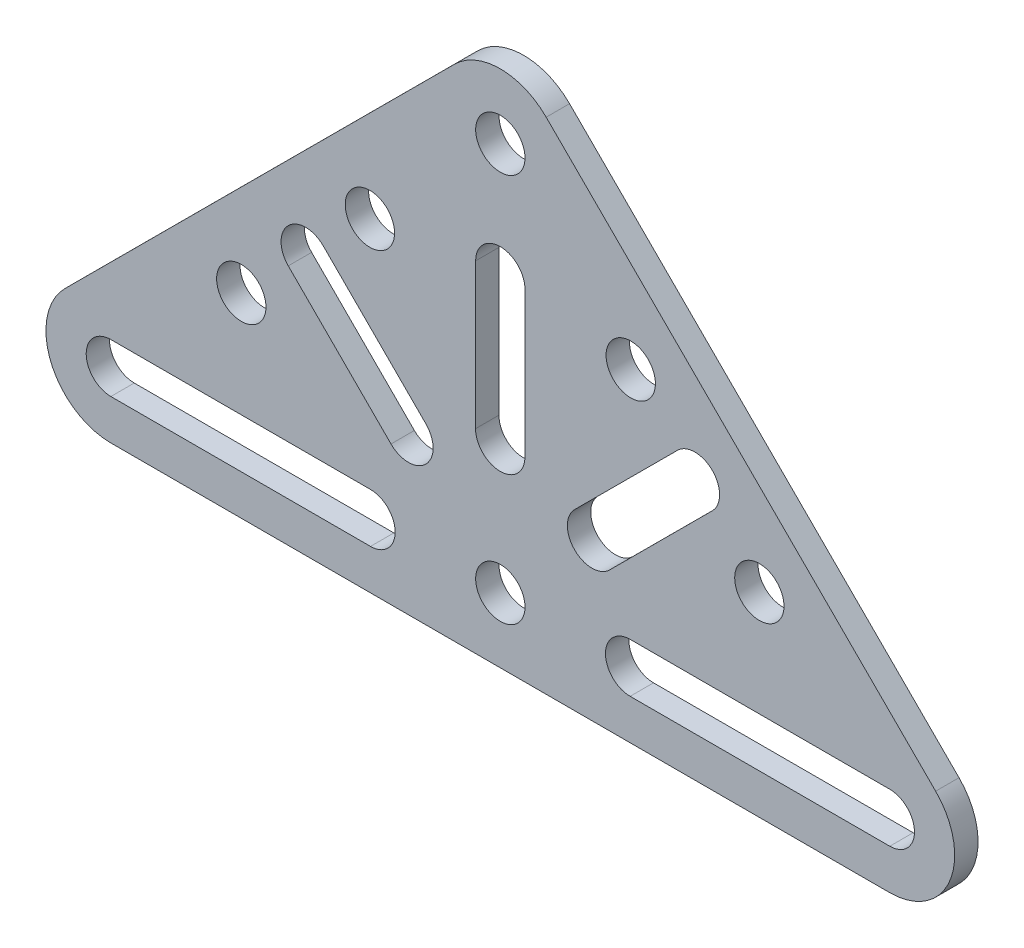
ISO-10303-21;
HEADER;
FILE_DESCRIPTION(('STEP AP214'),'2;1');
FILE_NAME('part.step','',(''),(''),'','','');
FILE_SCHEMA(('AUTOMOTIVE_DESIGN { 1 0 10303 214 1 1 1 1 }'));
ENDSEC;
DATA;
#1=APPLICATION_CONTEXT('core data for automotive mechanical design processes');
#2=APPLICATION_PROTOCOL_DEFINITION('international standard','automotive_design',2000,#1);
#3=PRODUCT_CONTEXT('',#1,'mechanical');
#4=PRODUCT('Part','Part','',(#3));
#5=PRODUCT_RELATED_PRODUCT_CATEGORY('part','',(#4));
#6=PRODUCT_DEFINITION_FORMATION('','',#4);
#7=PRODUCT_DEFINITION_CONTEXT('part definition',#1,'design');
#8=PRODUCT_DEFINITION('design','',#6,#7);
#9=PRODUCT_DEFINITION_SHAPE('','',#8);
#10=(LENGTH_UNIT() NAMED_UNIT(*) SI_UNIT(.MILLI.,.METRE.));
#11=(NAMED_UNIT(*) PLANE_ANGLE_UNIT() SI_UNIT($,.RADIAN.));
#12=(NAMED_UNIT(*) SI_UNIT($,.STERADIAN.) SOLID_ANGLE_UNIT());
#13=UNCERTAINTY_MEASURE_WITH_UNIT(LENGTH_MEASURE(1.E-05),#10,'distance_accuracy_value','');
#14=(GEOMETRIC_REPRESENTATION_CONTEXT(3) GLOBAL_UNCERTAINTY_ASSIGNED_CONTEXT((#13)) GLOBAL_UNIT_ASSIGNED_CONTEXT((#10,
#11,#12)) REPRESENTATION_CONTEXT('',''));
#15=CARTESIAN_POINT('',(0.,0.,0.));
#16=DIRECTION('',(0.,0.,1.));
#17=DIRECTION('',(1.,0.,0.));
#18=AXIS2_PLACEMENT_3D('',#15,#16,#17);
#19=CARTESIAN_POINT('',(-38.1,0.,2.286));
#20=DIRECTION('',(0.,0.,-1.));
#21=DIRECTION('',(-1.,0.,0.));
#22=AXIS2_PLACEMENT_3D('',#19,#20,#21);
#23=CYLINDRICAL_SURFACE('',#22,6.35);
#24=CARTESIAN_POINT('',(-38.1,0.,0.));
#25=DIRECTION('',(0.,0.,1.));
#26=DIRECTION('',(1.,0.,0.));
#27=AXIS2_PLACEMENT_3D('',#24,#25,#26);
#28=CIRCLE('',#27,6.35);
#29=CARTESIAN_POINT('',(-42.5873298500313,4.49292452830198,0.));
#30=VERTEX_POINT('',#29);
#31=CARTESIAN_POINT('',(-38.0999999999998,-6.35000000000001,0.));
#32=VERTEX_POINT('',#31);
#33=EDGE_CURVE('E401',#30,#32,#28,.T.);
#34=ORIENTED_EDGE('',*,*,#33,.T.);
#35=DIRECTION('',(0.,0.,-1.));
#36=VECTOR('',#35,1.);
#37=CARTESIAN_POINT('',(-38.0999999999998,-6.35000000000001,2.286));
#38=LINE('',#37,#36);
#39=CARTESIAN_POINT('',(-38.0999999999998,-6.35000000000001,2.286));
#40=VERTEX_POINT('',#39);
#41=EDGE_CURVE('E11',#40,#32,#38,.T.);
#42=ORIENTED_EDGE('',*,*,#41,.F.);
#43=CARTESIAN_POINT('',(-38.1,0.,2.286));
#44=DIRECTION('',(0.,0.,1.));
#45=DIRECTION('',(1.,0.,0.));
#46=AXIS2_PLACEMENT_3D('',#43,#44,#45);
#47=CIRCLE('',#46,6.35);
#48=CARTESIAN_POINT('',(-42.5873298500313,4.49292452830198,2.286));
#49=VERTEX_POINT('',#48);
#50=EDGE_CURVE('E404',#49,#40,#47,.T.);
#51=ORIENTED_EDGE('',*,*,#50,.F.);
#52=DIRECTION('',(0.,0.,-1.));
#53=VECTOR('',#52,1.);
#54=CARTESIAN_POINT('',(-42.5873298500313,4.49292452830198,2.286));
#55=LINE('',#54,#53);
#56=EDGE_CURVE('E418',#49,#30,#55,.T.);
#57=ORIENTED_EDGE('',*,*,#56,.T.);
#58=EDGE_LOOP('',(#34,#42,#51,#57));
#59=FACE_BOUND('',#58,.T.);
#60=ADVANCED_FACE('F32',(#59),#23,.T.);
#61=CARTESIAN_POINT('',(38.0999999999998,-6.35000000000001,2.286));
#62=DIRECTION('',(0.,1.,0.));
#63=DIRECTION('',(0.,0.,1.));
#64=AXIS2_PLACEMENT_3D('',#61,#62,#63);
#65=PLANE('',#64);
#66=DIRECTION('',(1.,0.,0.));
#67=VECTOR('',#66,1.);
#68=CARTESIAN_POINT('',(38.0999999999998,-6.35000000000001,0.));
#69=LINE('',#68,#67);
#70=CARTESIAN_POINT('',(38.0999999999998,-6.35000000000001,0.));
#71=VERTEX_POINT('',#70);
#72=EDGE_CURVE('E421',#32,#71,#69,.T.);
#73=ORIENTED_EDGE('',*,*,#72,.T.);
#74=DIRECTION('',(0.,0.,-1.));
#75=VECTOR('',#74,1.);
#76=CARTESIAN_POINT('',(38.0999999999998,-6.35000000000001,2.286));
#77=LINE('',#76,#75);
#78=CARTESIAN_POINT('',(38.0999999999998,-6.35000000000001,2.286));
#79=VERTEX_POINT('',#78);
#80=EDGE_CURVE('E39',#79,#71,#77,.T.);
#81=ORIENTED_EDGE('',*,*,#80,.F.);
#82=DIRECTION('',(1.,0.,0.));
#83=VECTOR('',#82,1.);
#84=CARTESIAN_POINT('',(38.0999999999998,-6.35000000000001,2.286));
#85=LINE('',#84,#83);
#86=EDGE_CURVE('E407',#40,#79,#85,.T.);
#87=ORIENTED_EDGE('',*,*,#86,.F.);
#88=ORIENTED_EDGE('',*,*,#41,.T.);
#89=EDGE_LOOP('',(#73,#81,#87,#88));
#90=FACE_BOUND('',#89,.T.);
#91=ADVANCED_FACE('F467',(#90),#65,.F.);
#92=CARTESIAN_POINT('',(38.1,0.,2.286));
#93=DIRECTION('',(0.,0.,-1.));
#94=DIRECTION('',(-1.,0.,0.));
#95=AXIS2_PLACEMENT_3D('',#92,#93,#94);
#96=CYLINDRICAL_SURFACE('',#95,6.35);
#97=CARTESIAN_POINT('',(38.1,0.,0.));
#98=DIRECTION('',(0.,0.,1.));
#99=DIRECTION('',(-1.,0.,0.));
#100=AXIS2_PLACEMENT_3D('',#97,#98,#99);
#101=CIRCLE('',#100,6.35);
#102=CARTESIAN_POINT('',(42.5873298500313,4.49292452830198,0.));
#103=VERTEX_POINT('',#102);
#104=EDGE_CURVE('E423',#71,#103,#101,.T.);
#105=ORIENTED_EDGE('',*,*,#104,.T.);
#106=DIRECTION('',(0.,0.,-1.));
#107=VECTOR('',#106,1.);
#108=CARTESIAN_POINT('',(42.5873298500313,4.49292452830198,2.286));
#109=LINE('',#108,#107);
#110=CARTESIAN_POINT('',(42.5873298500313,4.49292452830198,2.286));
#111=VERTEX_POINT('',#110);
#112=EDGE_CURVE('E438',#111,#103,#109,.T.);
#113=ORIENTED_EDGE('',*,*,#112,.F.);
#114=CARTESIAN_POINT('',(38.1,0.,2.286));
#115=DIRECTION('',(0.,0.,1.));
#116=DIRECTION('',(-1.,0.,0.));
#117=AXIS2_PLACEMENT_3D('',#114,#115,#116);
#118=CIRCLE('',#117,6.35);
#119=EDGE_CURVE('E410',#79,#111,#118,.T.);
#120=ORIENTED_EDGE('',*,*,#119,.F.);
#121=ORIENTED_EDGE('',*,*,#80,.T.);
#122=EDGE_LOOP('',(#105,#113,#120,#121));
#123=FACE_BOUND('',#122,.T.);
#124=ADVANCED_FACE('F445',(#123),#96,.T.);
#125=CARTESIAN_POINT('',(42.5873298500313,4.49292452830198,2.286));
#126=DIRECTION('',(-0.706666118115189,-0.707547169811321,0.));
#127=DIRECTION('',(0.707547169811321,-0.706666118115189,0.));
#128=AXIS2_PLACEMENT_3D('',#125,#126,#127);
#129=PLANE('',#128);
#130=DIRECTION('',(-0.707547169811321,0.706666118115189,0.));
#131=VECTOR('',#130,1.);
#132=CARTESIAN_POINT('',(42.5873298500313,4.49292452830198,0.));
#133=LINE('',#132,#131);
#134=CARTESIAN_POINT('',(4.48732985003148,42.5454816565685,0.));
#135=VERTEX_POINT('',#134);
#136=EDGE_CURVE('E425',#103,#135,#133,.T.);
#137=ORIENTED_EDGE('',*,*,#136,.T.);
#138=DIRECTION('',(0.,0.,-1.));
#139=VECTOR('',#138,1.);
#140=CARTESIAN_POINT('',(4.48732985003148,42.5454816565685,2.286));
#141=LINE('',#140,#139);
#142=CARTESIAN_POINT('',(4.48732985003148,42.5454816565685,2.286));
#143=VERTEX_POINT('',#142);
#144=EDGE_CURVE('E435',#143,#135,#141,.T.);
#145=ORIENTED_EDGE('',*,*,#144,.F.);
#146=DIRECTION('',(-0.707547169811321,0.706666118115189,0.));
#147=VECTOR('',#146,1.);
#148=CARTESIAN_POINT('',(42.5873298500313,4.49292452830198,2.286));
#149=LINE('',#148,#147);
#150=EDGE_CURVE('E412',#111,#143,#149,.T.);
#151=ORIENTED_EDGE('',*,*,#150,.F.);
#152=ORIENTED_EDGE('',*,*,#112,.T.);
#153=EDGE_LOOP('',(#137,#145,#151,#152));
#154=FACE_BOUND('',#153,.T.);
#155=ADVANCED_FACE('F456',(#154),#129,.F.);
#156=CARTESIAN_POINT('',(0.,38.0525571282667,2.286));
#157=DIRECTION('',(0.,0.,-1.));
#158=DIRECTION('',(-1.,0.,0.));
#159=AXIS2_PLACEMENT_3D('',#156,#157,#158);
#160=CYLINDRICAL_SURFACE('',#159,6.35);
#161=CARTESIAN_POINT('',(0.,38.0525571282667,0.));
#162=DIRECTION('',(0.,0.,1.));
#163=DIRECTION('',(-1.,0.,0.));
#164=AXIS2_PLACEMENT_3D('',#161,#162,#163);
#165=CIRCLE('',#164,6.35);
#166=CARTESIAN_POINT('',(-4.48732985003148,42.5454816565685,0.));
#167=VERTEX_POINT('',#166);
#168=EDGE_CURVE('E427',#135,#167,#165,.T.);
#169=ORIENTED_EDGE('',*,*,#168,.T.);
#170=DIRECTION('',(0.,0.,-1.));
#171=VECTOR('',#170,1.);
#172=CARTESIAN_POINT('',(-4.48732985003148,42.5454816565685,2.286));
#173=LINE('',#172,#171);
#174=CARTESIAN_POINT('',(-4.48732985003148,42.5454816565685,2.286));
#175=VERTEX_POINT('',#174);
#176=EDGE_CURVE('E432',#175,#167,#173,.T.);
#177=ORIENTED_EDGE('',*,*,#176,.F.);
#178=CARTESIAN_POINT('',(0.,38.0525571282667,2.286));
#179=DIRECTION('',(0.,0.,1.));
#180=DIRECTION('',(-1.,0.,0.));
#181=AXIS2_PLACEMENT_3D('',#178,#179,#180);
#182=CIRCLE('',#181,6.35);
#183=EDGE_CURVE('E414',#143,#175,#182,.T.);
#184=ORIENTED_EDGE('',*,*,#183,.F.);
#185=ORIENTED_EDGE('',*,*,#144,.T.);
#186=EDGE_LOOP('',(#169,#177,#184,#185));
#187=FACE_BOUND('',#186,.T.);
#188=ADVANCED_FACE('F460',(#187),#160,.T.);
#189=CARTESIAN_POINT('',(-42.5873298500313,4.49292452830198,2.286));
#190=DIRECTION('',(0.706666118115189,-0.707547169811321,0.));
#191=DIRECTION('',(0.707547169811321,0.706666118115189,0.));
#192=AXIS2_PLACEMENT_3D('',#189,#190,#191);
#193=PLANE('',#192);
#194=DIRECTION('',(-0.707547169811321,-0.706666118115189,0.));
#195=VECTOR('',#194,1.);
#196=CARTESIAN_POINT('',(-42.5873298500313,4.49292452830198,0.));
#197=LINE('',#196,#195);
#198=EDGE_CURVE('E408',#167,#30,#197,.T.);
#199=ORIENTED_EDGE('',*,*,#198,.T.);
#200=ORIENTED_EDGE('',*,*,#56,.F.);
#201=DIRECTION('',(-0.707547169811321,-0.706666118115189,0.));
#202=VECTOR('',#201,1.);
#203=CARTESIAN_POINT('',(-42.5873298500313,4.49292452830198,2.286));
#204=LINE('',#203,#202);
#205=EDGE_CURVE('E416',#175,#49,#204,.T.);
#206=ORIENTED_EDGE('',*,*,#205,.F.);
#207=ORIENTED_EDGE('',*,*,#176,.T.);
#208=EDGE_LOOP('',(#199,#200,#206,#207));
#209=FACE_BOUND('',#208,.T.);
#210=ADVANCED_FACE('F470',(#209),#193,.F.);
#211=CARTESIAN_POINT('',(-38.1,0.,2.286));
#212=DIRECTION('',(0.,0.,1.));
#213=DIRECTION('',(1.,0.,0.));
#214=AXIS2_PLACEMENT_3D('',#211,#212,#213);
#215=PLANE('',#214);
#216=CARTESIAN_POINT('',(19.0381318928662,19.038131892866,2.286));
#217=DIRECTION('',(0.,0.,1.));
#218=DIRECTION('',(0.,-1.,0.));
#219=AXIS2_PLACEMENT_3D('',#216,#217,#218);
#220=CIRCLE('',#219,2.413);
#221=CARTESIAN_POINT('',(20.7433172358781,17.3308205721113,2.286));
#222=VERTEX_POINT('',#221);
#223=CARTESIAN_POINT('',(17.3329465498542,20.7454432136207,2.286));
#224=VERTEX_POINT('',#223);
#225=EDGE_CURVE('E46',#222,#224,#220,.T.);
#226=ORIENTED_EDGE('',*,*,#225,.F.);
#227=DIRECTION('',(0.707547169811323,0.706666118115187,0.));
#228=VECTOR('',#227,1.);
#229=CARTESIAN_POINT('',(20.7433172358781,17.3308205721113,2.286));
#230=LINE('',#229,#228);
#231=CARTESIAN_POINT('',(10.6791662924818,7.27920170804089,2.286));
#232=VERTEX_POINT('',#231);
#233=EDGE_CURVE('E222',#232,#222,#230,.T.);
#234=ORIENTED_EDGE('',*,*,#233,.F.);
#235=CARTESIAN_POINT('',(8.97398094946989,8.98651302879561,2.286));
#236=DIRECTION('',(0.,0.,1.));
#237=DIRECTION('',(0.,1.,0.));
#238=AXIS2_PLACEMENT_3D('',#235,#236,#237);
#239=CIRCLE('',#238,2.413);
#240=CARTESIAN_POINT('',(7.26879560645795,10.6938243495503,2.286));
#241=VERTEX_POINT('',#240);
#242=EDGE_CURVE('E216',#241,#232,#239,.T.);
#243=ORIENTED_EDGE('',*,*,#242,.F.);
#244=DIRECTION('',(-0.707547169811323,-0.706666118115186,0.));
#245=VECTOR('',#244,1.);
#246=CARTESIAN_POINT('',(17.3329465498542,20.7454432136207,2.286));
#247=LINE('',#246,#245);
#248=EDGE_CURVE('E206',#224,#241,#247,.T.);
#249=ORIENTED_EDGE('',*,*,#248,.F.);
#250=EDGE_LOOP('',(#226,#234,#243,#249));
#251=FACE_BOUND('',#250,.T.);
#252=CARTESIAN_POINT('',(0.,26.923984325139,2.286));
#253=DIRECTION('',(0.,0.,1.));
#254=DIRECTION('',(0.707106781186546,-0.707106781186549,0.));
#255=AXIS2_PLACEMENT_3D('',#252,#253,#254);
#256=CIRCLE('',#255,2.413);
#257=CARTESIAN_POINT('',(2.41299953172593,26.9224810318604,2.286));
#258=VERTEX_POINT('',#257);
#259=CARTESIAN_POINT('',(-2.41299953172583,26.9254876184176,2.286));
#260=VERTEX_POINT('',#259);
#261=EDGE_CURVE('E266',#258,#260,#256,.T.);
#262=ORIENTED_EDGE('',*,*,#261,.F.);
#263=DIRECTION('',(0.000622997628912436,0.999999805936958,0.));
#264=VECTOR('',#263,1.);
#265=CARTESIAN_POINT('',(2.41299953172593,26.9224810318604,2.286));
#266=LINE('',#265,#264);
#267=CARTESIAN_POINT('',(2.40413801345228,12.6984837922131,2.286));
#268=VERTEX_POINT('',#267);
#269=EDGE_CURVE('E258',#268,#258,#266,.T.);
#270=ORIENTED_EDGE('',*,*,#269,.F.);
#271=CARTESIAN_POINT('',(-0.00886151827360088,12.6999870854917,2.286));
#272=DIRECTION('',(0.,0.,1.));
#273=DIRECTION('',(-0.707106781186546,0.707106781186549,0.));
#274=AXIS2_PLACEMENT_3D('',#271,#272,#273);
#275=CIRCLE('',#274,2.413);
#276=CARTESIAN_POINT('',(-2.42186104999948,12.7014903787703,2.286));
#277=VERTEX_POINT('',#276);
#278=EDGE_CURVE('E250',#277,#268,#275,.T.);
#279=ORIENTED_EDGE('',*,*,#278,.F.);
#280=DIRECTION('',(-0.000622997628912603,-0.999999805936958,0.));
#281=VECTOR('',#280,1.);
#282=CARTESIAN_POINT('',(-2.41299953172583,26.9254876184175,2.286));
#283=LINE('',#282,#281);
#284=EDGE_CURVE('E239',#260,#277,#283,.T.);
#285=ORIENTED_EDGE('',*,*,#284,.F.);
#286=EDGE_LOOP('',(#262,#270,#279,#285));
#287=FACE_BOUND('',#286,.T.);
#288=CARTESIAN_POINT('',(-19.0381318928661,19.0381318928661,2.286));
#289=DIRECTION('',(0.,0.,1.));
#290=DIRECTION('',(1.,0.,0.));
#291=AXIS2_PLACEMENT_3D('',#288,#289,#290);
#292=CIRCLE('',#291,2.413);
#293=CARTESIAN_POINT('',(-17.3308205721114,20.743317235878,2.286));
#294=VERTEX_POINT('',#293);
#295=CARTESIAN_POINT('',(-20.7454432136208,17.3329465498541,2.286));
#296=VERTEX_POINT('',#295);
#297=EDGE_CURVE('E271',#294,#296,#292,.T.);
#298=ORIENTED_EDGE('',*,*,#297,.F.);
#299=DIRECTION('',(-0.706666118115189,0.707547169811321,0.));
#300=VECTOR('',#299,1.);
#301=CARTESIAN_POINT('',(-17.3308205721114,20.743317235878,2.286));
#302=LINE('',#301,#300);
#303=CARTESIAN_POINT('',(-7.27920170804092,10.6791662924818,2.286));
#304=VERTEX_POINT('',#303);
#305=EDGE_CURVE('E276',#304,#294,#302,.T.);
#306=ORIENTED_EDGE('',*,*,#305,.F.);
#307=CARTESIAN_POINT('',(-8.98651302879564,8.97398094946986,2.286));
#308=DIRECTION('',(0.,0.,1.));
#309=DIRECTION('',(-1.,0.,0.));
#310=AXIS2_PLACEMENT_3D('',#307,#308,#309);
#311=CIRCLE('',#310,2.413);
#312=CARTESIAN_POINT('',(-10.6938243495504,7.26879560645791,2.286));
#313=VERTEX_POINT('',#312);
#314=EDGE_CURVE('E290',#313,#304,#311,.T.);
#315=ORIENTED_EDGE('',*,*,#314,.F.);
#316=DIRECTION('',(0.706666118115189,-0.707547169811321,0.));
#317=VECTOR('',#316,1.);
#318=CARTESIAN_POINT('',(-20.7454432136208,17.3329465498541,2.286));
#319=LINE('',#318,#317);
#320=EDGE_CURVE('E287',#296,#313,#319,.T.);
#321=ORIENTED_EDGE('',*,*,#320,.F.);
#322=EDGE_LOOP('',(#298,#306,#315,#321));
#323=FACE_BOUND('',#322,.T.);
#324=CARTESIAN_POINT('',(38.1,0.,2.286));
#325=DIRECTION('',(0.,0.,-1.));
#326=DIRECTION('',(-1.,0.,0.));
#327=AXIS2_PLACEMENT_3D('',#324,#325,#326);
#328=CIRCLE('',#327,2.41299999999999);
#329=CARTESIAN_POINT('',(38.1,2.41299999999998,2.286));
#330=VERTEX_POINT('',#329);
#331=CARTESIAN_POINT('',(38.1,-2.413,2.286));
#332=VERTEX_POINT('',#331);
#333=EDGE_CURVE('E330',#330,#332,#328,.T.);
#334=ORIENTED_EDGE('',*,*,#333,.T.);
#335=DIRECTION('',(-1.,0.,0.));
#336=VECTOR('',#335,1.);
#337=CARTESIAN_POINT('',(38.1,-2.413,2.286));
#338=LINE('',#337,#336);
#339=CARTESIAN_POINT('',(12.7,-2.413,2.286));
#340=VERTEX_POINT('',#339);
#341=EDGE_CURVE('E297',#332,#340,#338,.T.);
#342=ORIENTED_EDGE('',*,*,#341,.T.);
#343=CARTESIAN_POINT('',(12.7,0.,2.286));
#344=DIRECTION('',(0.,0.,-1.));
#345=DIRECTION('',(1.,0.,0.));
#346=AXIS2_PLACEMENT_3D('',#343,#344,#345);
#347=CIRCLE('',#346,2.41299999999999);
#348=CARTESIAN_POINT('',(12.7,2.41299999999998,2.286));
#349=VERTEX_POINT('',#348);
#350=EDGE_CURVE('E314',#340,#349,#347,.T.);
#351=ORIENTED_EDGE('',*,*,#350,.T.);
#352=DIRECTION('',(1.,0.,0.));
#353=VECTOR('',#352,1.);
#354=CARTESIAN_POINT('',(38.1,2.41299999999998,2.286));
#355=LINE('',#354,#353);
#356=EDGE_CURVE('E322',#349,#330,#355,.T.);
#357=ORIENTED_EDGE('',*,*,#356,.T.);
#358=EDGE_LOOP('',(#334,#342,#351,#357));
#359=FACE_BOUND('',#358,.T.);
#360=CARTESIAN_POINT('',(-38.1,0.,2.286));
#361=DIRECTION('',(0.,0.,1.));
#362=DIRECTION('',(1.,0.,0.));
#363=AXIS2_PLACEMENT_3D('',#360,#361,#362);
#364=CIRCLE('',#363,2.41299999999999);
#365=CARTESIAN_POINT('',(-38.1,2.41299999999998,2.286));
#366=VERTEX_POINT('',#365);
#367=CARTESIAN_POINT('',(-38.1,-2.413,2.286));
#368=VERTEX_POINT('',#367);
#369=EDGE_CURVE('E335',#366,#368,#364,.T.);
#370=ORIENTED_EDGE('',*,*,#369,.F.);
#371=DIRECTION('',(-1.,0.,0.));
#372=VECTOR('',#371,1.);
#373=CARTESIAN_POINT('',(-38.1,2.41299999999998,2.286));
#374=LINE('',#373,#372);
#375=CARTESIAN_POINT('',(-12.7,2.41299999999998,2.286));
#376=VERTEX_POINT('',#375);
#377=EDGE_CURVE('E340',#376,#366,#374,.T.);
#378=ORIENTED_EDGE('',*,*,#377,.F.);
#379=CARTESIAN_POINT('',(-12.7,0.,2.286));
#380=DIRECTION('',(0.,0.,1.));
#381=DIRECTION('',(-1.,0.,0.));
#382=AXIS2_PLACEMENT_3D('',#379,#380,#381);
#383=CIRCLE('',#382,2.41299999999999);
#384=CARTESIAN_POINT('',(-12.7,-2.41299999999999,2.286));
#385=VERTEX_POINT('',#384);
#386=EDGE_CURVE('E354',#385,#376,#383,.T.);
#387=ORIENTED_EDGE('',*,*,#386,.F.);
#388=DIRECTION('',(1.,0.,0.));
#389=VECTOR('',#388,1.);
#390=CARTESIAN_POINT('',(-38.1,-2.413,2.286));
#391=LINE('',#390,#389);
#392=EDGE_CURVE('E351',#368,#385,#391,.T.);
#393=ORIENTED_EDGE('',*,*,#392,.F.);
#394=EDGE_LOOP('',(#370,#378,#387,#393));
#395=FACE_BOUND('',#394,.T.);
#396=CARTESIAN_POINT('',(12.7599056603774,25.3085403541774,2.286));
#397=DIRECTION('',(0.,0.,1.));
#398=DIRECTION('',(-1.,0.,0.));
#399=AXIS2_PLACEMENT_3D('',#396,#397,#398);
#400=CIRCLE('',#399,2.413);
#401=CARTESIAN_POINT('',(10.3469056603774,25.3085403541774,2.286));
#402=VERTEX_POINT('',#401);
#403=EDGE_CURVE('E361',#402,#402,#400,.T.);
#404=ORIENTED_EDGE('',*,*,#403,.F.);
#405=EDGE_LOOP('',(#404));
#406=FACE_BOUND('',#405,.T.);
#407=CARTESIAN_POINT('',(-12.7599056603774,25.3085403541774,2.286));
#408=DIRECTION('',(0.,0.,1.));
#409=DIRECTION('',(1.,0.,0.));
#410=AXIS2_PLACEMENT_3D('',#407,#408,#409);
#411=CIRCLE('',#410,2.413);
#412=CARTESIAN_POINT('',(-10.3469056603774,25.3085403541774,2.286));
#413=VERTEX_POINT('',#412);
#414=EDGE_CURVE('E371',#413,#413,#411,.T.);
#415=ORIENTED_EDGE('',*,*,#414,.F.);
#416=EDGE_LOOP('',(#415));
#417=FACE_BOUND('',#416,.T.);
#418=CARTESIAN_POINT('',(25.3400943396226,12.7440167740893,2.286));
#419=DIRECTION('',(0.,0.,1.));
#420=DIRECTION('',(-1.,0.,0.));
#421=AXIS2_PLACEMENT_3D('',#418,#419,#420);
#422=CIRCLE('',#421,2.41299999999999);
#423=CARTESIAN_POINT('',(22.9270943396226,12.7440167740893,2.286));
#424=VERTEX_POINT('',#423);
#425=EDGE_CURVE('E377',#424,#424,#422,.T.);
#426=ORIENTED_EDGE('',*,*,#425,.F.);
#427=EDGE_LOOP('',(#426));
#428=FACE_BOUND('',#427,.T.);
#429=CARTESIAN_POINT('',(-25.3400943396226,12.7440167740893,2.286));
#430=DIRECTION('',(0.,0.,1.));
#431=DIRECTION('',(1.,0.,0.));
#432=AXIS2_PLACEMENT_3D('',#429,#430,#431);
#433=CIRCLE('',#432,2.413);
#434=CARTESIAN_POINT('',(-22.9270943396226,12.7440167740893,2.286));
#435=VERTEX_POINT('',#434);
#436=EDGE_CURVE('E383',#435,#435,#433,.T.);
#437=ORIENTED_EDGE('',*,*,#436,.F.);
#438=EDGE_LOOP('',(#437));
#439=FACE_BOUND('',#438,.T.);
#440=CARTESIAN_POINT('',(0.,38.0525571282667,2.286));
#441=DIRECTION('',(0.,0.,1.));
#442=DIRECTION('',(1.,0.,0.));
#443=AXIS2_PLACEMENT_3D('',#440,#441,#442);
#444=CIRCLE('',#443,2.413);
#445=CARTESIAN_POINT('',(2.413,38.0525571282667,2.286));
#446=VERTEX_POINT('',#445);
#447=EDGE_CURVE('E389',#446,#446,#444,.T.);
#448=ORIENTED_EDGE('',*,*,#447,.F.);
#449=EDGE_LOOP('',(#448));
#450=FACE_BOUND('',#449,.T.);
#451=CARTESIAN_POINT('',(0.,0.,2.286));
#452=DIRECTION('',(0.,0.,1.));
#453=DIRECTION('',(1.,0.,0.));
#454=AXIS2_PLACEMENT_3D('',#451,#452,#453);
#455=CIRCLE('',#454,2.413);
#456=CARTESIAN_POINT('',(2.413,0.,2.286));
#457=VERTEX_POINT('',#456);
#458=EDGE_CURVE('E395',#457,#457,#455,.T.);
#459=ORIENTED_EDGE('',*,*,#458,.F.);
#460=EDGE_LOOP('',(#459));
#461=FACE_BOUND('',#460,.T.);
#462=ORIENTED_EDGE('',*,*,#50,.T.);
#463=ORIENTED_EDGE('',*,*,#86,.T.);
#464=ORIENTED_EDGE('',*,*,#119,.T.);
#465=ORIENTED_EDGE('',*,*,#150,.T.);
#466=ORIENTED_EDGE('',*,*,#183,.T.);
#467=ORIENTED_EDGE('',*,*,#205,.T.);
#468=EDGE_LOOP('',(#462,#463,#464,#465,#466,#467));
#469=FACE_BOUND('',#468,.T.);
#470=ADVANCED_FACE('F220',(#251,#287,#323,#359,#395,#406,#417,#428,#439,#450,#461,#469),#215,.T.);
#471=CARTESIAN_POINT('',(-38.1,0.,0.));
#472=DIRECTION('',(0.,0.,1.));
#473=DIRECTION('',(1.,0.,0.));
#474=AXIS2_PLACEMENT_3D('',#471,#472,#473);
#475=PLANE('',#474);
#476=DIRECTION('',(0.707547169811323,0.706666118115187,0.));
#477=VECTOR('',#476,1.);
#478=CARTESIAN_POINT('',(20.7433172358781,17.3308205721113,0.));
#479=LINE('',#478,#477);
#480=CARTESIAN_POINT('',(10.6791662924818,7.27920170804089,0.));
#481=VERTEX_POINT('',#480);
#482=CARTESIAN_POINT('',(20.7433172358781,17.3308205721113,0.));
#483=VERTEX_POINT('',#482);
#484=EDGE_CURVE('E232',#481,#483,#479,.T.);
#485=ORIENTED_EDGE('',*,*,#484,.T.);
#486=CARTESIAN_POINT('',(19.0381318928662,19.038131892866,0.));
#487=DIRECTION('',(0.,0.,1.));
#488=DIRECTION('',(0.,-1.,0.));
#489=AXIS2_PLACEMENT_3D('',#486,#487,#488);
#490=CIRCLE('',#489,2.413);
#491=CARTESIAN_POINT('',(17.3329465498542,20.7454432136207,0.));
#492=VERTEX_POINT('',#491);
#493=EDGE_CURVE('E236',#483,#492,#490,.T.);
#494=ORIENTED_EDGE('',*,*,#493,.T.);
#495=DIRECTION('',(-0.707547169811323,-0.706666118115186,0.));
#496=VECTOR('',#495,1.);
#497=CARTESIAN_POINT('',(17.3329465498542,20.7454432136207,0.));
#498=LINE('',#497,#496);
#499=CARTESIAN_POINT('',(7.26879560645795,10.6938243495503,0.));
#500=VERTEX_POINT('',#499);
#501=EDGE_CURVE('E213',#492,#500,#498,.T.);
#502=ORIENTED_EDGE('',*,*,#501,.T.);
#503=CARTESIAN_POINT('',(8.97398094946989,8.98651302879561,0.));
#504=DIRECTION('',(0.,0.,1.));
#505=DIRECTION('',(0.,1.,0.));
#506=AXIS2_PLACEMENT_3D('',#503,#504,#505);
#507=CIRCLE('',#506,2.413);
#508=EDGE_CURVE('E54',#500,#481,#507,.T.);
#509=ORIENTED_EDGE('',*,*,#508,.T.);
#510=EDGE_LOOP('',(#485,#494,#502,#509));
#511=FACE_BOUND('',#510,.T.);
#512=DIRECTION('',(0.000622997628912436,0.999999805936958,0.));
#513=VECTOR('',#512,1.);
#514=CARTESIAN_POINT('',(2.41299953172593,26.9224810318604,0.));
#515=LINE('',#514,#513);
#516=CARTESIAN_POINT('',(2.40413801345228,12.6984837922131,0.));
#517=VERTEX_POINT('',#516);
#518=CARTESIAN_POINT('',(2.41299953172593,26.9224810318604,0.));
#519=VERTEX_POINT('',#518);
#520=EDGE_CURVE('E263',#517,#519,#515,.T.);
#521=ORIENTED_EDGE('',*,*,#520,.T.);
#522=CARTESIAN_POINT('',(0.,26.923984325139,0.));
#523=DIRECTION('',(0.,0.,1.));
#524=DIRECTION('',(0.707106781186546,-0.707106781186549,0.));
#525=AXIS2_PLACEMENT_3D('',#522,#523,#524);
#526=CIRCLE('',#525,2.413);
#527=CARTESIAN_POINT('',(-2.41299953172583,26.9254876184175,0.));
#528=VERTEX_POINT('',#527);
#529=EDGE_CURVE('E268',#519,#528,#526,.T.);
#530=ORIENTED_EDGE('',*,*,#529,.T.);
#531=DIRECTION('',(-0.000622997628912603,-0.999999805936958,0.));
#532=VECTOR('',#531,1.);
#533=CARTESIAN_POINT('',(-2.41299953172583,26.9254876184175,0.));
#534=LINE('',#533,#532);
#535=CARTESIAN_POINT('',(-2.42186104999948,12.7014903787703,0.));
#536=VERTEX_POINT('',#535);
#537=EDGE_CURVE('E241',#528,#536,#534,.T.);
#538=ORIENTED_EDGE('',*,*,#537,.T.);
#539=CARTESIAN_POINT('',(-0.00886151827360088,12.6999870854917,0.));
#540=DIRECTION('',(0.,0.,1.));
#541=DIRECTION('',(-0.707106781186546,0.707106781186549,0.));
#542=AXIS2_PLACEMENT_3D('',#539,#540,#541);
#543=CIRCLE('',#542,2.413);
#544=EDGE_CURVE('E255',#536,#517,#543,.T.);
#545=ORIENTED_EDGE('',*,*,#544,.T.);
#546=EDGE_LOOP('',(#521,#530,#538,#545));
#547=FACE_BOUND('',#546,.T.);
#548=DIRECTION('',(-0.706666118115189,0.707547169811321,0.));
#549=VECTOR('',#548,1.);
#550=CARTESIAN_POINT('',(-17.3308205721114,20.743317235878,0.));
#551=LINE('',#550,#549);
#552=CARTESIAN_POINT('',(-7.27920170804092,10.6791662924818,0.));
#553=VERTEX_POINT('',#552);
#554=CARTESIAN_POINT('',(-17.3308205721114,20.743317235878,0.));
#555=VERTEX_POINT('',#554);
#556=EDGE_CURVE('E282',#553,#555,#551,.T.);
#557=ORIENTED_EDGE('',*,*,#556,.T.);
#558=CARTESIAN_POINT('',(-19.0381318928661,19.0381318928661,0.));
#559=DIRECTION('',(0.,0.,1.));
#560=DIRECTION('',(1.,0.,0.));
#561=AXIS2_PLACEMENT_3D('',#558,#559,#560);
#562=CIRCLE('',#561,2.413);
#563=CARTESIAN_POINT('',(-20.7454432136208,17.3329465498541,0.));
#564=VERTEX_POINT('',#563);
#565=EDGE_CURVE('E272',#555,#564,#562,.T.);
#566=ORIENTED_EDGE('',*,*,#565,.T.);
#567=DIRECTION('',(0.706666118115189,-0.707547169811321,0.));
#568=VECTOR('',#567,1.);
#569=CARTESIAN_POINT('',(-20.7454432136208,17.3329465498541,0.));
#570=LINE('',#569,#568);
#571=CARTESIAN_POINT('',(-10.6938243495504,7.26879560645791,0.));
#572=VERTEX_POINT('',#571);
#573=EDGE_CURVE('E275',#564,#572,#570,.T.);
#574=ORIENTED_EDGE('',*,*,#573,.T.);
#575=CARTESIAN_POINT('',(-8.98651302879564,8.97398094946986,0.));
#576=DIRECTION('',(0.,0.,1.));
#577=DIRECTION('',(-1.,0.,0.));
#578=AXIS2_PLACEMENT_3D('',#575,#576,#577);
#579=CIRCLE('',#578,2.413);
#580=EDGE_CURVE('E279',#572,#553,#579,.T.);
#581=ORIENTED_EDGE('',*,*,#580,.T.);
#582=EDGE_LOOP('',(#557,#566,#574,#581));
#583=FACE_BOUND('',#582,.T.);
#584=DIRECTION('',(-1.,0.,0.));
#585=VECTOR('',#584,1.);
#586=CARTESIAN_POINT('',(38.1,-2.413,0.));
#587=LINE('',#586,#585);
#588=CARTESIAN_POINT('',(38.1,-2.413,0.));
#589=VERTEX_POINT('',#588);
#590=CARTESIAN_POINT('',(12.7,-2.413,0.));
#591=VERTEX_POINT('',#590);
#592=EDGE_CURVE('E306',#589,#591,#587,.T.);
#593=ORIENTED_EDGE('',*,*,#592,.F.);
#594=CARTESIAN_POINT('',(38.1,0.,0.));
#595=DIRECTION('',(0.,0.,-1.));
#596=DIRECTION('',(-1.,0.,0.));
#597=AXIS2_PLACEMENT_3D('',#594,#595,#596);
#598=CIRCLE('',#597,2.41299999999999);
#599=CARTESIAN_POINT('',(38.1,2.41299999999998,0.));
#600=VERTEX_POINT('',#599);
#601=EDGE_CURVE('E333',#600,#589,#598,.T.);
#602=ORIENTED_EDGE('',*,*,#601,.F.);
#603=DIRECTION('',(1.,0.,0.));
#604=VECTOR('',#603,1.);
#605=CARTESIAN_POINT('',(38.1,2.41299999999998,0.));
#606=LINE('',#605,#604);
#607=CARTESIAN_POINT('',(12.7,2.41299999999998,0.));
#608=VERTEX_POINT('',#607);
#609=EDGE_CURVE('E327',#608,#600,#606,.T.);
#610=ORIENTED_EDGE('',*,*,#609,.F.);
#611=CARTESIAN_POINT('',(12.7,0.,0.));
#612=DIRECTION('',(0.,0.,-1.));
#613=DIRECTION('',(1.,0.,0.));
#614=AXIS2_PLACEMENT_3D('',#611,#612,#613);
#615=CIRCLE('',#614,2.41299999999999);
#616=EDGE_CURVE('E319',#591,#608,#615,.T.);
#617=ORIENTED_EDGE('',*,*,#616,.F.);
#618=EDGE_LOOP('',(#593,#602,#610,#617));
#619=FACE_BOUND('',#618,.T.);
#620=DIRECTION('',(-1.,0.,0.));
#621=VECTOR('',#620,1.);
#622=CARTESIAN_POINT('',(-38.1,2.41299999999998,0.));
#623=LINE('',#622,#621);
#624=CARTESIAN_POINT('',(-12.7,2.41299999999998,0.));
#625=VERTEX_POINT('',#624);
#626=CARTESIAN_POINT('',(-38.1,2.41299999999998,0.));
#627=VERTEX_POINT('',#626);
#628=EDGE_CURVE('E346',#625,#627,#623,.T.);
#629=ORIENTED_EDGE('',*,*,#628,.T.);
#630=CARTESIAN_POINT('',(-38.1,0.,0.));
#631=DIRECTION('',(0.,0.,1.));
#632=DIRECTION('',(1.,0.,0.));
#633=AXIS2_PLACEMENT_3D('',#630,#631,#632);
#634=CIRCLE('',#633,2.41299999999999);
#635=CARTESIAN_POINT('',(-38.1,-2.413,0.));
#636=VERTEX_POINT('',#635);
#637=EDGE_CURVE('E336',#627,#636,#634,.T.);
#638=ORIENTED_EDGE('',*,*,#637,.T.);
#639=DIRECTION('',(1.,0.,0.));
#640=VECTOR('',#639,1.);
#641=CARTESIAN_POINT('',(-38.1,-2.413,0.));
#642=LINE('',#641,#640);
#643=CARTESIAN_POINT('',(-12.7,-2.413,0.));
#644=VERTEX_POINT('',#643);
#645=EDGE_CURVE('E339',#636,#644,#642,.T.);
#646=ORIENTED_EDGE('',*,*,#645,.T.);
#647=CARTESIAN_POINT('',(-12.7,0.,0.));
#648=DIRECTION('',(0.,0.,1.));
#649=DIRECTION('',(-1.,0.,0.));
#650=AXIS2_PLACEMENT_3D('',#647,#648,#649);
#651=CIRCLE('',#650,2.41299999999999);
#652=EDGE_CURVE('E343',#644,#625,#651,.T.);
#653=ORIENTED_EDGE('',*,*,#652,.T.);
#654=EDGE_LOOP('',(#629,#638,#646,#653));
#655=FACE_BOUND('',#654,.T.);
#656=CARTESIAN_POINT('',(12.7599056603774,25.3085403541774,0.));
#657=DIRECTION('',(0.,0.,1.));
#658=DIRECTION('',(-1.,0.,0.));
#659=AXIS2_PLACEMENT_3D('',#656,#657,#658);
#660=CIRCLE('',#659,2.413);
#661=CARTESIAN_POINT('',(10.3469056603774,25.3085403541774,0.));
#662=VERTEX_POINT('',#661);
#663=EDGE_CURVE('E368',#662,#662,#660,.T.);
#664=ORIENTED_EDGE('',*,*,#663,.T.);
#665=EDGE_LOOP('',(#664));
#666=FACE_BOUND('',#665,.T.);
#667=CARTESIAN_POINT('',(-12.7599056603774,25.3085403541774,0.));
#668=DIRECTION('',(0.,0.,1.));
#669=DIRECTION('',(1.,0.,0.));
#670=AXIS2_PLACEMENT_3D('',#667,#668,#669);
#671=CIRCLE('',#670,2.413);
#672=CARTESIAN_POINT('',(-10.3469056603774,25.3085403541774,0.));
#673=VERTEX_POINT('',#672);
#674=EDGE_CURVE('E374',#673,#673,#671,.T.);
#675=ORIENTED_EDGE('',*,*,#674,.T.);
#676=EDGE_LOOP('',(#675));
#677=FACE_BOUND('',#676,.T.);
#678=CARTESIAN_POINT('',(25.3400943396226,12.7440167740893,0.));
#679=DIRECTION('',(0.,0.,1.));
#680=DIRECTION('',(-1.,0.,0.));
#681=AXIS2_PLACEMENT_3D('',#678,#679,#680);
#682=CIRCLE('',#681,2.41299999999999);
#683=CARTESIAN_POINT('',(22.9270943396226,12.7440167740893,0.));
#684=VERTEX_POINT('',#683);
#685=EDGE_CURVE('E380',#684,#684,#682,.T.);
#686=ORIENTED_EDGE('',*,*,#685,.T.);
#687=EDGE_LOOP('',(#686));
#688=FACE_BOUND('',#687,.T.);
#689=CARTESIAN_POINT('',(-25.3400943396226,12.7440167740893,0.));
#690=DIRECTION('',(0.,0.,1.));
#691=DIRECTION('',(1.,0.,0.));
#692=AXIS2_PLACEMENT_3D('',#689,#690,#691);
#693=CIRCLE('',#692,2.413);
#694=CARTESIAN_POINT('',(-22.9270943396226,12.7440167740893,0.));
#695=VERTEX_POINT('',#694);
#696=EDGE_CURVE('E386',#695,#695,#693,.T.);
#697=ORIENTED_EDGE('',*,*,#696,.T.);
#698=EDGE_LOOP('',(#697));
#699=FACE_BOUND('',#698,.T.);
#700=CARTESIAN_POINT('',(0.,38.0525571282667,0.));
#701=DIRECTION('',(0.,0.,1.));
#702=DIRECTION('',(1.,0.,0.));
#703=AXIS2_PLACEMENT_3D('',#700,#701,#702);
#704=CIRCLE('',#703,2.413);
#705=CARTESIAN_POINT('',(2.413,38.0525571282667,0.));
#706=VERTEX_POINT('',#705);
#707=EDGE_CURVE('E392',#706,#706,#704,.T.);
#708=ORIENTED_EDGE('',*,*,#707,.T.);
#709=EDGE_LOOP('',(#708));
#710=FACE_BOUND('',#709,.T.);
#711=CARTESIAN_POINT('',(0.,0.,0.));
#712=DIRECTION('',(0.,0.,1.));
#713=DIRECTION('',(1.,0.,0.));
#714=AXIS2_PLACEMENT_3D('',#711,#712,#713);
#715=CIRCLE('',#714,2.413);
#716=CARTESIAN_POINT('',(2.413,0.,0.));
#717=VERTEX_POINT('',#716);
#718=EDGE_CURVE('E398',#717,#717,#715,.T.);
#719=ORIENTED_EDGE('',*,*,#718,.T.);
#720=EDGE_LOOP('',(#719));
#721=FACE_BOUND('',#720,.T.);
#722=ORIENTED_EDGE('',*,*,#33,.F.);
#723=ORIENTED_EDGE('',*,*,#198,.F.);
#724=ORIENTED_EDGE('',*,*,#168,.F.);
#725=ORIENTED_EDGE('',*,*,#136,.F.);
#726=ORIENTED_EDGE('',*,*,#104,.F.);
#727=ORIENTED_EDGE('',*,*,#72,.F.);
#728=EDGE_LOOP('',(#722,#723,#724,#725,#726,#727));
#729=FACE_BOUND('',#728,.T.);
#730=ADVANCED_FACE('F451',(#511,#547,#583,#619,#655,#666,#677,#688,#699,#710,#721,#729),#475,.F.);
#731=CARTESIAN_POINT('',(0.,0.,0.));
#732=DIRECTION('',(0.,0.,1.));
#733=DIRECTION('',(1.,0.,0.));
#734=AXIS2_PLACEMENT_3D('',#731,#732,#733);
#735=CYLINDRICAL_SURFACE('',#734,2.413);
#736=ORIENTED_EDGE('',*,*,#718,.F.);
#737=EDGE_LOOP('',(#736));
#738=FACE_BOUND('',#737,.T.);
#739=ORIENTED_EDGE('',*,*,#458,.T.);
#740=EDGE_LOOP('',(#739));
#741=FACE_BOUND('',#740,.T.);
#742=ADVANCED_FACE('F508',(#738,#741),#735,.F.);
#743=CARTESIAN_POINT('',(0.,38.0525571282667,0.));
#744=DIRECTION('',(0.,0.,1.));
#745=DIRECTION('',(1.,0.,0.));
#746=AXIS2_PLACEMENT_3D('',#743,#744,#745);
#747=CYLINDRICAL_SURFACE('',#746,2.413);
#748=ORIENTED_EDGE('',*,*,#707,.F.);
#749=EDGE_LOOP('',(#748));
#750=FACE_BOUND('',#749,.T.);
#751=ORIENTED_EDGE('',*,*,#447,.T.);
#752=EDGE_LOOP('',(#751));
#753=FACE_BOUND('',#752,.T.);
#754=ADVANCED_FACE('F513',(#750,#753),#747,.F.);
#755=CARTESIAN_POINT('',(-25.3400943396226,12.7440167740893,0.));
#756=DIRECTION('',(0.,0.,1.));
#757=DIRECTION('',(1.,0.,0.));
#758=AXIS2_PLACEMENT_3D('',#755,#756,#757);
#759=CYLINDRICAL_SURFACE('',#758,2.413);
#760=ORIENTED_EDGE('',*,*,#696,.F.);
#761=EDGE_LOOP('',(#760));
#762=FACE_BOUND('',#761,.T.);
#763=ORIENTED_EDGE('',*,*,#436,.T.);
#764=EDGE_LOOP('',(#763));
#765=FACE_BOUND('',#764,.T.);
#766=ADVANCED_FACE('F525',(#762,#765),#759,.F.);
#767=CARTESIAN_POINT('',(25.3400943396226,12.7440167740893,0.));
#768=DIRECTION('',(0.,0.,1.));
#769=DIRECTION('',(1.,0.,0.));
#770=AXIS2_PLACEMENT_3D('',#767,#768,#769);
#771=CYLINDRICAL_SURFACE('',#770,2.41299999999999);
#772=ORIENTED_EDGE('',*,*,#685,.F.);
#773=EDGE_LOOP('',(#772));
#774=FACE_BOUND('',#773,.T.);
#775=ORIENTED_EDGE('',*,*,#425,.T.);
#776=EDGE_LOOP('',(#775));
#777=FACE_BOUND('',#776,.T.);
#778=ADVANCED_FACE('F535',(#774,#777),#771,.F.);
#779=CARTESIAN_POINT('',(-12.7599056603774,25.3085403541774,0.));
#780=DIRECTION('',(0.,0.,1.));
#781=DIRECTION('',(1.,0.,0.));
#782=AXIS2_PLACEMENT_3D('',#779,#780,#781);
#783=CYLINDRICAL_SURFACE('',#782,2.413);
#784=ORIENTED_EDGE('',*,*,#674,.F.);
#785=EDGE_LOOP('',(#784));
#786=FACE_BOUND('',#785,.T.);
#787=ORIENTED_EDGE('',*,*,#414,.T.);
#788=EDGE_LOOP('',(#787));
#789=FACE_BOUND('',#788,.T.);
#790=ADVANCED_FACE('F545',(#786,#789),#783,.F.);
#791=CARTESIAN_POINT('',(12.7599056603774,25.3085403541774,0.));
#792=DIRECTION('',(0.,0.,1.));
#793=DIRECTION('',(1.,0.,0.));
#794=AXIS2_PLACEMENT_3D('',#791,#792,#793);
#795=CYLINDRICAL_SURFACE('',#794,2.413);
#796=ORIENTED_EDGE('',*,*,#663,.F.);
#797=EDGE_LOOP('',(#796));
#798=FACE_BOUND('',#797,.T.);
#799=ORIENTED_EDGE('',*,*,#403,.T.);
#800=EDGE_LOOP('',(#799));
#801=FACE_BOUND('',#800,.T.);
#802=ADVANCED_FACE('F555',(#798,#801),#795,.F.);
#803=CARTESIAN_POINT('',(-38.1,0.,0.));
#804=DIRECTION('',(0.,0.,1.));
#805=DIRECTION('',(1.,0.,0.));
#806=AXIS2_PLACEMENT_3D('',#803,#804,#805);
#807=CYLINDRICAL_SURFACE('',#806,2.41299999999999);
#808=ORIENTED_EDGE('',*,*,#369,.T.);
#809=DIRECTION('',(0.,0.,1.));
#810=VECTOR('',#809,1.);
#811=CARTESIAN_POINT('',(-38.1,-2.413,0.));
#812=LINE('',#811,#810);
#813=EDGE_CURVE('E349',#636,#368,#812,.T.);
#814=ORIENTED_EDGE('',*,*,#813,.F.);
#815=ORIENTED_EDGE('',*,*,#637,.F.);
#816=DIRECTION('',(0.,0.,1.));
#817=VECTOR('',#816,1.);
#818=CARTESIAN_POINT('',(-38.1,2.41299999999998,0.));
#819=LINE('',#818,#817);
#820=EDGE_CURVE('E359',#627,#366,#819,.T.);
#821=ORIENTED_EDGE('',*,*,#820,.T.);
#822=EDGE_LOOP('',(#808,#814,#815,#821));
#823=FACE_BOUND('',#822,.T.);
#824=ADVANCED_FACE('F565',(#823),#807,.F.);
#825=CARTESIAN_POINT('',(-38.1,2.41299999999998,0.));
#826=DIRECTION('',(0.,1.,0.));
#827=DIRECTION('',(-1.,0.,0.));
#828=AXIS2_PLACEMENT_3D('',#825,#826,#827);
#829=PLANE('',#828);
#830=ORIENTED_EDGE('',*,*,#377,.T.);
#831=ORIENTED_EDGE('',*,*,#820,.F.);
#832=ORIENTED_EDGE('',*,*,#628,.F.);
#833=DIRECTION('',(0.,0.,1.));
#834=VECTOR('',#833,1.);
#835=CARTESIAN_POINT('',(-12.7,2.41299999999998,0.));
#836=LINE('',#835,#834);
#837=EDGE_CURVE('E362',#625,#376,#836,.T.);
#838=ORIENTED_EDGE('',*,*,#837,.T.);
#839=EDGE_LOOP('',(#830,#831,#832,#838));
#840=FACE_BOUND('',#839,.T.);
#841=ADVANCED_FACE('F575',(#840),#829,.F.);
#842=CARTESIAN_POINT('',(-12.7,0.,0.));
#843=DIRECTION('',(0.,0.,1.));
#844=DIRECTION('',(1.,0.,0.));
#845=AXIS2_PLACEMENT_3D('',#842,#843,#844);
#846=CYLINDRICAL_SURFACE('',#845,2.41299999999999);
#847=ORIENTED_EDGE('',*,*,#386,.T.);
#848=ORIENTED_EDGE('',*,*,#837,.F.);
#849=ORIENTED_EDGE('',*,*,#652,.F.);
#850=DIRECTION('',(0.,0.,1.));
#851=VECTOR('',#850,1.);
#852=CARTESIAN_POINT('',(-12.7,-2.41299999999999,0.));
#853=LINE('',#852,#851);
#854=EDGE_CURVE('E364',#644,#385,#853,.T.);
#855=ORIENTED_EDGE('',*,*,#854,.T.);
#856=EDGE_LOOP('',(#847,#848,#849,#855));
#857=FACE_BOUND('',#856,.T.);
#858=ADVANCED_FACE('F585',(#857),#846,.F.);
#859=CARTESIAN_POINT('',(-38.1,-2.413,0.));
#860=DIRECTION('',(0.,-1.,0.));
#861=DIRECTION('',(1.,0.,0.));
#862=AXIS2_PLACEMENT_3D('',#859,#860,#861);
#863=PLANE('',#862);
#864=ORIENTED_EDGE('',*,*,#392,.T.);
#865=ORIENTED_EDGE('',*,*,#854,.F.);
#866=ORIENTED_EDGE('',*,*,#645,.F.);
#867=ORIENTED_EDGE('',*,*,#813,.T.);
#868=EDGE_LOOP('',(#864,#865,#866,#867));
#869=FACE_BOUND('',#868,.T.);
#870=ADVANCED_FACE('F595',(#869),#863,.F.);
#871=CARTESIAN_POINT('',(38.1,0.,0.));
#872=DIRECTION('',(0.,0.,1.));
#873=DIRECTION('',(-1.,0.,0.));
#874=AXIS2_PLACEMENT_3D('',#871,#872,#873);
#875=CYLINDRICAL_SURFACE('',#874,2.41299999999999);
#876=ORIENTED_EDGE('',*,*,#333,.F.);
#877=DIRECTION('',(0.,0.,1.));
#878=VECTOR('',#877,1.);
#879=CARTESIAN_POINT('',(38.1,2.41299999999998,0.));
#880=LINE('',#879,#878);
#881=EDGE_CURVE('E325',#600,#330,#880,.T.);
#882=ORIENTED_EDGE('',*,*,#881,.F.);
#883=ORIENTED_EDGE('',*,*,#601,.T.);
#884=DIRECTION('',(0.,0.,1.));
#885=VECTOR('',#884,1.);
#886=CARTESIAN_POINT('',(38.1,-2.413,0.));
#887=LINE('',#886,#885);
#888=EDGE_CURVE('E312',#589,#332,#887,.T.);
#889=ORIENTED_EDGE('',*,*,#888,.T.);
#890=EDGE_LOOP('',(#876,#882,#883,#889));
#891=FACE_BOUND('',#890,.T.);
#892=ADVANCED_FACE('F605',(#891),#875,.F.);
#893=CARTESIAN_POINT('',(38.1,2.41299999999998,0.));
#894=DIRECTION('',(0.,1.,0.));
#895=DIRECTION('',(1.,0.,0.));
#896=AXIS2_PLACEMENT_3D('',#893,#894,#895);
#897=PLANE('',#896);
#898=ORIENTED_EDGE('',*,*,#356,.F.);
#899=DIRECTION('',(0.,0.,1.));
#900=VECTOR('',#899,1.);
#901=CARTESIAN_POINT('',(12.7,2.41299999999998,0.));
#902=LINE('',#901,#900);
#903=EDGE_CURVE('E317',#608,#349,#902,.T.);
#904=ORIENTED_EDGE('',*,*,#903,.F.);
#905=ORIENTED_EDGE('',*,*,#609,.T.);
#906=ORIENTED_EDGE('',*,*,#881,.T.);
#907=EDGE_LOOP('',(#898,#904,#905,#906));
#908=FACE_BOUND('',#907,.T.);
#909=ADVANCED_FACE('F615',(#908),#897,.F.);
#910=CARTESIAN_POINT('',(12.7,0.,0.));
#911=DIRECTION('',(0.,0.,1.));
#912=DIRECTION('',(-1.,0.,0.));
#913=AXIS2_PLACEMENT_3D('',#910,#911,#912);
#914=CYLINDRICAL_SURFACE('',#913,2.41299999999999);
#915=ORIENTED_EDGE('',*,*,#350,.F.);
#916=DIRECTION('',(0.,0.,1.));
#917=VECTOR('',#916,1.);
#918=CARTESIAN_POINT('',(12.7,-2.41299999999999,0.));
#919=LINE('',#918,#917);
#920=EDGE_CURVE('E309',#591,#340,#919,.T.);
#921=ORIENTED_EDGE('',*,*,#920,.F.);
#922=ORIENTED_EDGE('',*,*,#616,.T.);
#923=ORIENTED_EDGE('',*,*,#903,.T.);
#924=EDGE_LOOP('',(#915,#921,#922,#923));
#925=FACE_BOUND('',#924,.T.);
#926=ADVANCED_FACE('F625',(#925),#914,.F.);
#927=CARTESIAN_POINT('',(38.1,-2.413,0.));
#928=DIRECTION('',(0.,-1.,0.));
#929=DIRECTION('',(-1.,0.,0.));
#930=AXIS2_PLACEMENT_3D('',#927,#928,#929);
#931=PLANE('',#930);
#932=ORIENTED_EDGE('',*,*,#341,.F.);
#933=ORIENTED_EDGE('',*,*,#888,.F.);
#934=ORIENTED_EDGE('',*,*,#592,.T.);
#935=ORIENTED_EDGE('',*,*,#920,.T.);
#936=EDGE_LOOP('',(#932,#933,#934,#935));
#937=FACE_BOUND('',#936,.T.);
#938=ADVANCED_FACE('F635',(#937),#931,.F.);
#939=CARTESIAN_POINT('',(-19.0381318928661,19.0381318928661,0.));
#940=DIRECTION('',(0.,0.,1.));
#941=DIRECTION('',(1.,0.,0.));
#942=AXIS2_PLACEMENT_3D('',#939,#940,#941);
#943=CYLINDRICAL_SURFACE('',#942,2.413);
#944=ORIENTED_EDGE('',*,*,#297,.T.);
#945=DIRECTION('',(0.,0.,1.));
#946=VECTOR('',#945,1.);
#947=CARTESIAN_POINT('',(-20.7454432136208,17.3329465498541,0.));
#948=LINE('',#947,#946);
#949=EDGE_CURVE('E285',#564,#296,#948,.T.);
#950=ORIENTED_EDGE('',*,*,#949,.F.);
#951=ORIENTED_EDGE('',*,*,#565,.F.);
#952=DIRECTION('',(0.,0.,1.));
#953=VECTOR('',#952,1.);
#954=CARTESIAN_POINT('',(-17.3308205721114,20.743317235878,0.));
#955=LINE('',#954,#953);
#956=EDGE_CURVE('E295',#555,#294,#955,.T.);
#957=ORIENTED_EDGE('',*,*,#956,.T.);
#958=EDGE_LOOP('',(#944,#950,#951,#957));
#959=FACE_BOUND('',#958,.T.);
#960=ADVANCED_FACE('F645',(#959),#943,.F.);
#961=CARTESIAN_POINT('',(-17.3308205721114,20.743317235878,0.));
#962=DIRECTION('',(0.707547169811321,0.706666118115189,0.));
#963=DIRECTION('',(-0.706666118115189,0.707547169811321,0.));
#964=AXIS2_PLACEMENT_3D('',#961,#962,#963);
#965=PLANE('',#964);
#966=ORIENTED_EDGE('',*,*,#305,.T.);
#967=ORIENTED_EDGE('',*,*,#956,.F.);
#968=ORIENTED_EDGE('',*,*,#556,.F.);
#969=DIRECTION('',(0.,0.,1.));
#970=VECTOR('',#969,1.);
#971=CARTESIAN_POINT('',(-7.27920170804092,10.6791662924818,0.));
#972=LINE('',#971,#970);
#973=EDGE_CURVE('E298',#553,#304,#972,.T.);
#974=ORIENTED_EDGE('',*,*,#973,.T.);
#975=EDGE_LOOP('',(#966,#967,#968,#974));
#976=FACE_BOUND('',#975,.T.);
#977=ADVANCED_FACE('F655',(#976),#965,.F.);
#978=CARTESIAN_POINT('',(-8.98651302879564,8.97398094946986,0.));
#979=DIRECTION('',(0.,0.,1.));
#980=DIRECTION('',(1.,0.,0.));
#981=AXIS2_PLACEMENT_3D('',#978,#979,#980);
#982=CYLINDRICAL_SURFACE('',#981,2.413);
#983=ORIENTED_EDGE('',*,*,#314,.T.);
#984=ORIENTED_EDGE('',*,*,#973,.F.);
#985=ORIENTED_EDGE('',*,*,#580,.F.);
#986=DIRECTION('',(0.,0.,1.));
#987=VECTOR('',#986,1.);
#988=CARTESIAN_POINT('',(-10.6938243495504,7.26879560645791,0.));
#989=LINE('',#988,#987);
#990=EDGE_CURVE('E300',#572,#313,#989,.T.);
#991=ORIENTED_EDGE('',*,*,#990,.T.);
#992=EDGE_LOOP('',(#983,#984,#985,#991));
#993=FACE_BOUND('',#992,.T.);
#994=ADVANCED_FACE('F665',(#993),#982,.F.);
#995=CARTESIAN_POINT('',(-20.7454432136208,17.3329465498541,0.));
#996=DIRECTION('',(-0.707547169811321,-0.706666118115189,0.));
#997=DIRECTION('',(0.706666118115189,-0.707547169811321,0.));
#998=AXIS2_PLACEMENT_3D('',#995,#996,#997);
#999=PLANE('',#998);
#1000=ORIENTED_EDGE('',*,*,#320,.T.);
#1001=ORIENTED_EDGE('',*,*,#990,.F.);
#1002=ORIENTED_EDGE('',*,*,#573,.F.);
#1003=ORIENTED_EDGE('',*,*,#949,.T.);
#1004=EDGE_LOOP('',(#1000,#1001,#1002,#1003));
#1005=FACE_BOUND('',#1004,.T.);
#1006=ADVANCED_FACE('F675',(#1005),#999,.F.);
#1007=CARTESIAN_POINT('',(0.,26.923984325139,0.));
#1008=DIRECTION('',(0.,0.,1.));
#1009=DIRECTION('',(0.707106781186546,-0.707106781186549,0.));
#1010=AXIS2_PLACEMENT_3D('',#1007,#1008,#1009);
#1011=CYLINDRICAL_SURFACE('',#1010,2.413);
#1012=ORIENTED_EDGE('',*,*,#261,.T.);
#1013=DIRECTION('',(0.,0.,1.));
#1014=VECTOR('',#1013,1.);
#1015=CARTESIAN_POINT('',(-2.41299953172583,26.9254876184175,0.));
#1016=LINE('',#1015,#1014);
#1017=EDGE_CURVE('E247',#528,#260,#1016,.T.);
#1018=ORIENTED_EDGE('',*,*,#1017,.F.);
#1019=ORIENTED_EDGE('',*,*,#529,.F.);
#1020=DIRECTION('',(0.,0.,1.));
#1021=VECTOR('',#1020,1.);
#1022=CARTESIAN_POINT('',(2.41299953172593,26.9224810318604,0.));
#1023=LINE('',#1022,#1021);
#1024=EDGE_CURVE('E260',#519,#258,#1023,.T.);
#1025=ORIENTED_EDGE('',*,*,#1024,.T.);
#1026=EDGE_LOOP('',(#1012,#1018,#1019,#1025));
#1027=FACE_BOUND('',#1026,.T.);
#1028=ADVANCED_FACE('F685',(#1027),#1011,.F.);
#1029=CARTESIAN_POINT('',(2.41299953172593,26.9224810318604,0.));
#1030=DIRECTION('',(0.999999805936958,-0.000622997628912547,0.));
#1031=DIRECTION('',(0.000622997628912547,0.999999805936958,0.));
#1032=AXIS2_PLACEMENT_3D('',#1029,#1030,#1031);
#1033=PLANE('',#1032);
#1034=ORIENTED_EDGE('',*,*,#269,.T.);
#1035=ORIENTED_EDGE('',*,*,#1024,.F.);
#1036=ORIENTED_EDGE('',*,*,#520,.F.);
#1037=DIRECTION('',(0.,0.,1.));
#1038=VECTOR('',#1037,1.);
#1039=CARTESIAN_POINT('',(2.40413801345228,12.6984837922131,0.));
#1040=LINE('',#1039,#1038);
#1041=EDGE_CURVE('E252',#517,#268,#1040,.T.);
#1042=ORIENTED_EDGE('',*,*,#1041,.T.);
#1043=EDGE_LOOP('',(#1034,#1035,#1036,#1042));
#1044=FACE_BOUND('',#1043,.T.);
#1045=ADVANCED_FACE('F707',(#1044),#1033,.F.);
#1046=CARTESIAN_POINT('',(-0.00886151827360088,12.6999870854917,0.));
#1047=DIRECTION('',(0.,0.,1.));
#1048=DIRECTION('',(0.707106781186546,-0.707106781186549,0.));
#1049=AXIS2_PLACEMENT_3D('',#1046,#1047,#1048);
#1050=CYLINDRICAL_SURFACE('',#1049,2.413);
#1051=ORIENTED_EDGE('',*,*,#278,.T.);
#1052=ORIENTED_EDGE('',*,*,#1041,.F.);
#1053=ORIENTED_EDGE('',*,*,#544,.F.);
#1054=DIRECTION('',(0.,0.,1.));
#1055=VECTOR('',#1054,1.);
#1056=CARTESIAN_POINT('',(-2.42186104999948,12.7014903787703,0.));
#1057=LINE('',#1056,#1055);
#1058=EDGE_CURVE('E244',#536,#277,#1057,.T.);
#1059=ORIENTED_EDGE('',*,*,#1058,.T.);
#1060=EDGE_LOOP('',(#1051,#1052,#1053,#1059));
#1061=FACE_BOUND('',#1060,.T.);
#1062=ADVANCED_FACE('F717',(#1061),#1050,.F.);
#1063=CARTESIAN_POINT('',(-2.41299953172583,26.9254876184175,0.));
#1064=DIRECTION('',(-0.999999805936958,0.000622997628912658,0.));
#1065=DIRECTION('',(-0.000622997628912658,-0.999999805936958,0.));
#1066=AXIS2_PLACEMENT_3D('',#1063,#1064,#1065);
#1067=PLANE('',#1066);
#1068=ORIENTED_EDGE('',*,*,#284,.T.);
#1069=ORIENTED_EDGE('',*,*,#1058,.F.);
#1070=ORIENTED_EDGE('',*,*,#537,.F.);
#1071=ORIENTED_EDGE('',*,*,#1017,.T.);
#1072=EDGE_LOOP('',(#1068,#1069,#1070,#1071));
#1073=FACE_BOUND('',#1072,.T.);
#1074=ADVANCED_FACE('F688',(#1073),#1067,.F.);
#1075=CARTESIAN_POINT('',(19.0381318928662,19.038131892866,0.));
#1076=DIRECTION('',(0.,0.,1.));
#1077=DIRECTION('',(0.,-1.,0.));
#1078=AXIS2_PLACEMENT_3D('',#1075,#1076,#1077);
#1079=CYLINDRICAL_SURFACE('',#1078,2.413);
#1080=ORIENTED_EDGE('',*,*,#225,.T.);
#1081=DIRECTION('',(0.,0.,1.));
#1082=VECTOR('',#1081,1.);
#1083=CARTESIAN_POINT('',(17.3329465498542,20.7454432136207,0.));
#1084=LINE('',#1083,#1082);
#1085=EDGE_CURVE('E210',#492,#224,#1084,.T.);
#1086=ORIENTED_EDGE('',*,*,#1085,.F.);
#1087=ORIENTED_EDGE('',*,*,#493,.F.);
#1088=DIRECTION('',(0.,0.,1.));
#1089=VECTOR('',#1088,1.);
#1090=CARTESIAN_POINT('',(20.7433172358781,17.3308205721113,0.));
#1091=LINE('',#1090,#1089);
#1092=EDGE_CURVE('E230',#483,#222,#1091,.T.);
#1093=ORIENTED_EDGE('',*,*,#1092,.T.);
#1094=EDGE_LOOP('',(#1080,#1086,#1087,#1093));
#1095=FACE_BOUND('',#1094,.T.);
#1096=ADVANCED_FACE('F736',(#1095),#1079,.F.);
#1097=CARTESIAN_POINT('',(20.7433172358781,17.3308205721113,0.));
#1098=DIRECTION('',(0.706666118115186,-0.707547169811323,0.));
#1099=DIRECTION('',(0.707547169811323,0.706666118115186,0.));
#1100=AXIS2_PLACEMENT_3D('',#1097,#1098,#1099);
#1101=PLANE('',#1100);
#1102=ORIENTED_EDGE('',*,*,#233,.T.);
#1103=ORIENTED_EDGE('',*,*,#1092,.F.);
#1104=ORIENTED_EDGE('',*,*,#484,.F.);
#1105=DIRECTION('',(0.,0.,1.));
#1106=VECTOR('',#1105,1.);
#1107=CARTESIAN_POINT('',(10.6791662924818,7.27920170804089,0.));
#1108=LINE('',#1107,#1106);
#1109=EDGE_CURVE('E223',#481,#232,#1108,.T.);
#1110=ORIENTED_EDGE('',*,*,#1109,.T.);
#1111=EDGE_LOOP('',(#1102,#1103,#1104,#1110));
#1112=FACE_BOUND('',#1111,.T.);
#1113=ADVANCED_FACE('F746',(#1112),#1101,.F.);
#1114=CARTESIAN_POINT('',(8.97398094946989,8.98651302879561,0.));
#1115=DIRECTION('',(0.,0.,1.));
#1116=DIRECTION('',(0.,-1.,0.));
#1117=AXIS2_PLACEMENT_3D('',#1114,#1115,#1116);
#1118=CYLINDRICAL_SURFACE('',#1117,2.413);
#1119=ORIENTED_EDGE('',*,*,#242,.T.);
#1120=ORIENTED_EDGE('',*,*,#1109,.F.);
#1121=ORIENTED_EDGE('',*,*,#508,.F.);
#1122=DIRECTION('',(0.,0.,1.));
#1123=VECTOR('',#1122,1.);
#1124=CARTESIAN_POINT('',(7.26879560645795,10.6938243495503,0.));
#1125=LINE('',#1124,#1123);
#1126=EDGE_CURVE('E208',#500,#241,#1125,.T.);
#1127=ORIENTED_EDGE('',*,*,#1126,.T.);
#1128=EDGE_LOOP('',(#1119,#1120,#1121,#1127));
#1129=FACE_BOUND('',#1128,.T.);
#1130=ADVANCED_FACE('F215',(#1129),#1118,.F.);
#1131=CARTESIAN_POINT('',(17.3329465498542,20.7454432136207,0.));
#1132=DIRECTION('',(-0.706666118115186,0.707547169811323,0.));
#1133=DIRECTION('',(-0.707547169811323,-0.706666118115186,0.));
#1134=AXIS2_PLACEMENT_3D('',#1131,#1132,#1133);
#1135=PLANE('',#1134);
#1136=ORIENTED_EDGE('',*,*,#248,.T.);
#1137=ORIENTED_EDGE('',*,*,#1126,.F.);
#1138=ORIENTED_EDGE('',*,*,#501,.F.);
#1139=ORIENTED_EDGE('',*,*,#1085,.T.);
#1140=EDGE_LOOP('',(#1136,#1137,#1138,#1139));
#1141=FACE_BOUND('',#1140,.T.);
#1142=ADVANCED_FACE('F207',(#1141),#1135,.F.);
#1143=CLOSED_SHELL('',(#60,#91,#124,#155,#188,#210,#470,#730,#742,#754,#766,#778,#790,#802,#824,
#841,#858,#870,#892,#909,#926,#938,#960,#977,#994,#1006,#1028,#1045,#1062,#1074,#1096,#1113,
#1130,#1142));
#1144=MANIFOLD_SOLID_BREP('B2',#1143);
#1145=ADVANCED_BREP_SHAPE_REPRESENTATION('',(#18,#1144),#14);
#1146=SHAPE_DEFINITION_REPRESENTATION(#9,#1145);
ENDSEC;
END-ISO-10303-21;
